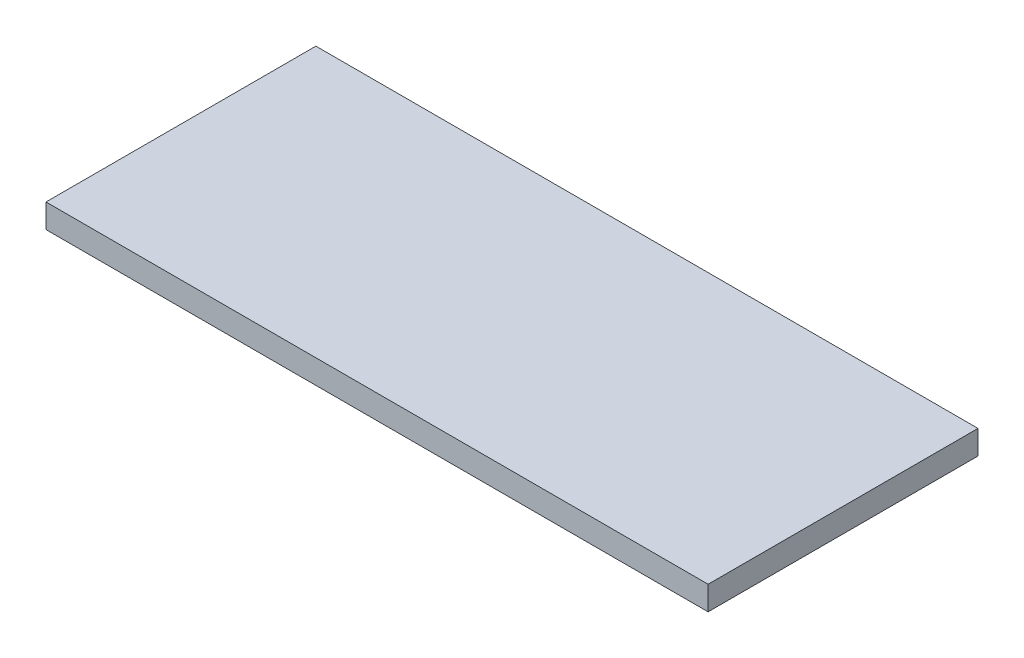
ISO-10303-21;
HEADER;
FILE_DESCRIPTION(('STEP AP214'),'2;1');
FILE_NAME('part.step','',(''),(''),'','','');
FILE_SCHEMA(('AUTOMOTIVE_DESIGN { 1 0 10303 214 1 1 1 1 }'));
ENDSEC;
DATA;
#1=APPLICATION_CONTEXT('core data for automotive mechanical design processes');
#2=APPLICATION_PROTOCOL_DEFINITION('international standard','automotive_design',2000,#1);
#3=PRODUCT_CONTEXT('',#1,'mechanical');
#4=PRODUCT('Part','Part','',(#3));
#5=PRODUCT_RELATED_PRODUCT_CATEGORY('part','',(#4));
#6=PRODUCT_DEFINITION_FORMATION('','',#4);
#7=PRODUCT_DEFINITION_CONTEXT('part definition',#1,'design');
#8=PRODUCT_DEFINITION('design','',#6,#7);
#9=PRODUCT_DEFINITION_SHAPE('','',#8);
#10=(LENGTH_UNIT() NAMED_UNIT(*) SI_UNIT(.MILLI.,.METRE.));
#11=(NAMED_UNIT(*) PLANE_ANGLE_UNIT() SI_UNIT($,.RADIAN.));
#12=(NAMED_UNIT(*) SI_UNIT($,.STERADIAN.) SOLID_ANGLE_UNIT());
#13=UNCERTAINTY_MEASURE_WITH_UNIT(LENGTH_MEASURE(1.E-05),#10,'distance_accuracy_value','');
#14=(GEOMETRIC_REPRESENTATION_CONTEXT(3) GLOBAL_UNCERTAINTY_ASSIGNED_CONTEXT((#13)) GLOBAL_UNIT_ASSIGNED_CONTEXT((#10,
#11,#12)) REPRESENTATION_CONTEXT('',''));
#15=CARTESIAN_POINT('',(0.,0.,0.));
#16=DIRECTION('',(0.,0.,1.));
#17=DIRECTION('',(1.,0.,0.));
#18=AXIS2_PLACEMENT_3D('',#15,#16,#17);
#19=CARTESIAN_POINT('',(-249.,18.,101.5));
#20=DIRECTION('',(1.,0.,0.));
#21=DIRECTION('',(0.,0.,-1.));
#22=AXIS2_PLACEMENT_3D('',#19,#20,#21);
#23=PLANE('',#22);
#24=DIRECTION('',(0.,0.,1.));
#25=VECTOR('',#24,1.);
#26=CARTESIAN_POINT('',(-249.,0.,101.5));
#27=LINE('',#26,#25);
#28=CARTESIAN_POINT('',(-249.,0.,-101.5));
#29=VERTEX_POINT('',#28);
#30=CARTESIAN_POINT('',(-249.,0.,101.5));
#31=VERTEX_POINT('',#30);
#32=EDGE_CURVE('E98',#29,#31,#27,.T.);
#33=ORIENTED_EDGE('',*,*,#32,.T.);
#34=DIRECTION('',(0.,-1.,0.));
#35=VECTOR('',#34,1.);
#36=CARTESIAN_POINT('',(-249.,18.,101.5));
#37=LINE('',#36,#35);
#38=CARTESIAN_POINT('',(-249.,18.,101.5));
#39=VERTEX_POINT('',#38);
#40=EDGE_CURVE('E11',#39,#31,#37,.T.);
#41=ORIENTED_EDGE('',*,*,#40,.F.);
#42=DIRECTION('',(0.,0.,1.));
#43=VECTOR('',#42,1.);
#44=CARTESIAN_POINT('',(-249.,18.,101.5));
#45=LINE('',#44,#43);
#46=CARTESIAN_POINT('',(-249.,18.,-101.5));
#47=VERTEX_POINT('',#46);
#48=EDGE_CURVE('E86',#47,#39,#45,.T.);
#49=ORIENTED_EDGE('',*,*,#48,.F.);
#50=DIRECTION('',(0.,-1.,0.));
#51=VECTOR('',#50,1.);
#52=CARTESIAN_POINT('',(-249.,18.,-101.5));
#53=LINE('',#52,#51);
#54=EDGE_CURVE('E94',#47,#29,#53,.T.);
#55=ORIENTED_EDGE('',*,*,#54,.T.);
#56=EDGE_LOOP('',(#33,#41,#49,#55));
#57=FACE_BOUND('',#56,.T.);
#58=ADVANCED_FACE('F35',(#57),#23,.F.);
#59=CARTESIAN_POINT('',(249.,18.,101.5));
#60=DIRECTION('',(0.,0.,-1.));
#61=DIRECTION('',(-1.,0.,0.));
#62=AXIS2_PLACEMENT_3D('',#59,#60,#61);
#63=PLANE('',#62);
#64=DIRECTION('',(1.,0.,0.));
#65=VECTOR('',#64,1.);
#66=CARTESIAN_POINT('',(249.,0.,101.5));
#67=LINE('',#66,#65);
#68=CARTESIAN_POINT('',(249.,0.,101.5));
#69=VERTEX_POINT('',#68);
#70=EDGE_CURVE('E90',#31,#69,#67,.T.);
#71=ORIENTED_EDGE('',*,*,#70,.T.);
#72=DIRECTION('',(0.,-1.,0.));
#73=VECTOR('',#72,1.);
#74=CARTESIAN_POINT('',(249.,18.,101.5));
#75=LINE('',#74,#73);
#76=CARTESIAN_POINT('',(249.,18.,101.5));
#77=VERTEX_POINT('',#76);
#78=EDGE_CURVE('E43',#77,#69,#75,.T.);
#79=ORIENTED_EDGE('',*,*,#78,.F.);
#80=DIRECTION('',(1.,0.,0.));
#81=VECTOR('',#80,1.);
#82=CARTESIAN_POINT('',(249.,18.,101.5));
#83=LINE('',#82,#81);
#84=EDGE_CURVE('E81',#39,#77,#83,.T.);
#85=ORIENTED_EDGE('',*,*,#84,.F.);
#86=ORIENTED_EDGE('',*,*,#40,.T.);
#87=EDGE_LOOP('',(#71,#79,#85,#86));
#88=FACE_BOUND('',#87,.T.);
#89=ADVANCED_FACE('F89',(#88),#63,.F.);
#90=CARTESIAN_POINT('',(249.,18.,101.5));
#91=DIRECTION('',(-1.,0.,0.));
#92=DIRECTION('',(0.,0.,1.));
#93=AXIS2_PLACEMENT_3D('',#90,#91,#92);
#94=PLANE('',#93);
#95=DIRECTION('',(0.,0.,-1.));
#96=VECTOR('',#95,1.);
#97=CARTESIAN_POINT('',(249.,0.,101.5));
#98=LINE('',#97,#96);
#99=CARTESIAN_POINT('',(249.,0.,-101.5));
#100=VERTEX_POINT('',#99);
#101=EDGE_CURVE('E68',#69,#100,#98,.T.);
#102=ORIENTED_EDGE('',*,*,#101,.T.);
#103=DIRECTION('',(0.,-1.,0.));
#104=VECTOR('',#103,1.);
#105=CARTESIAN_POINT('',(249.,18.,-101.5));
#106=LINE('',#105,#104);
#107=CARTESIAN_POINT('',(249.,18.,-101.5));
#108=VERTEX_POINT('',#107);
#109=EDGE_CURVE('E91',#108,#100,#106,.T.);
#110=ORIENTED_EDGE('',*,*,#109,.F.);
#111=DIRECTION('',(0.,0.,-1.));
#112=VECTOR('',#111,1.);
#113=CARTESIAN_POINT('',(249.,18.,101.5));
#114=LINE('',#113,#112);
#115=EDGE_CURVE('E84',#77,#108,#114,.T.);
#116=ORIENTED_EDGE('',*,*,#115,.F.);
#117=ORIENTED_EDGE('',*,*,#78,.T.);
#118=EDGE_LOOP('',(#102,#110,#116,#117));
#119=FACE_BOUND('',#118,.T.);
#120=ADVANCED_FACE('F92',(#119),#94,.F.);
#121=CARTESIAN_POINT('',(249.,18.,-101.5));
#122=DIRECTION('',(0.,0.,1.));
#123=DIRECTION('',(1.,0.,0.));
#124=AXIS2_PLACEMENT_3D('',#121,#122,#123);
#125=PLANE('',#124);
#126=DIRECTION('',(-1.,0.,0.));
#127=VECTOR('',#126,1.);
#128=CARTESIAN_POINT('',(249.,0.,-101.5));
#129=LINE('',#128,#127);
#130=EDGE_CURVE('E74',#100,#29,#129,.T.);
#131=ORIENTED_EDGE('',*,*,#130,.T.);
#132=ORIENTED_EDGE('',*,*,#54,.F.);
#133=DIRECTION('',(-1.,0.,0.));
#134=VECTOR('',#133,1.);
#135=CARTESIAN_POINT('',(249.,18.,-101.5));
#136=LINE('',#135,#134);
#137=EDGE_CURVE('E51',#108,#47,#136,.T.);
#138=ORIENTED_EDGE('',*,*,#137,.F.);
#139=ORIENTED_EDGE('',*,*,#109,.T.);
#140=EDGE_LOOP('',(#131,#132,#138,#139));
#141=FACE_BOUND('',#140,.T.);
#142=ADVANCED_FACE('F105',(#141),#125,.F.);
#143=CARTESIAN_POINT('',(0.,18.,0.));
#144=DIRECTION('',(0.,1.,0.));
#145=DIRECTION('',(0.,0.,1.));
#146=AXIS2_PLACEMENT_3D('',#143,#144,#145);
#147=PLANE('',#146);
#148=ORIENTED_EDGE('',*,*,#48,.T.);
#149=ORIENTED_EDGE('',*,*,#84,.T.);
#150=ORIENTED_EDGE('',*,*,#115,.T.);
#151=ORIENTED_EDGE('',*,*,#137,.T.);
#152=EDGE_LOOP('',(#148,#149,#150,#151));
#153=FACE_BOUND('',#152,.T.);
#154=ADVANCED_FACE('F82',(#153),#147,.T.);
#155=CARTESIAN_POINT('',(0.,0.,0.));
#156=DIRECTION('',(0.,1.,0.));
#157=DIRECTION('',(0.,0.,1.));
#158=AXIS2_PLACEMENT_3D('',#155,#156,#157);
#159=PLANE('',#158);
#160=ORIENTED_EDGE('',*,*,#32,.F.);
#161=ORIENTED_EDGE('',*,*,#130,.F.);
#162=ORIENTED_EDGE('',*,*,#101,.F.);
#163=ORIENTED_EDGE('',*,*,#70,.F.);
#164=EDGE_LOOP('',(#160,#161,#162,#163));
#165=FACE_BOUND('',#164,.T.);
#166=ADVANCED_FACE('F108',(#165),#159,.F.);
#167=CLOSED_SHELL('',(#58,#89,#120,#142,#154,#166));
#168=MANIFOLD_SOLID_BREP('B2',#167);
#169=ADVANCED_BREP_SHAPE_REPRESENTATION('',(#18,#168),#14);
#170=SHAPE_DEFINITION_REPRESENTATION(#9,#169);
ENDSEC;
END-ISO-10303-21;
